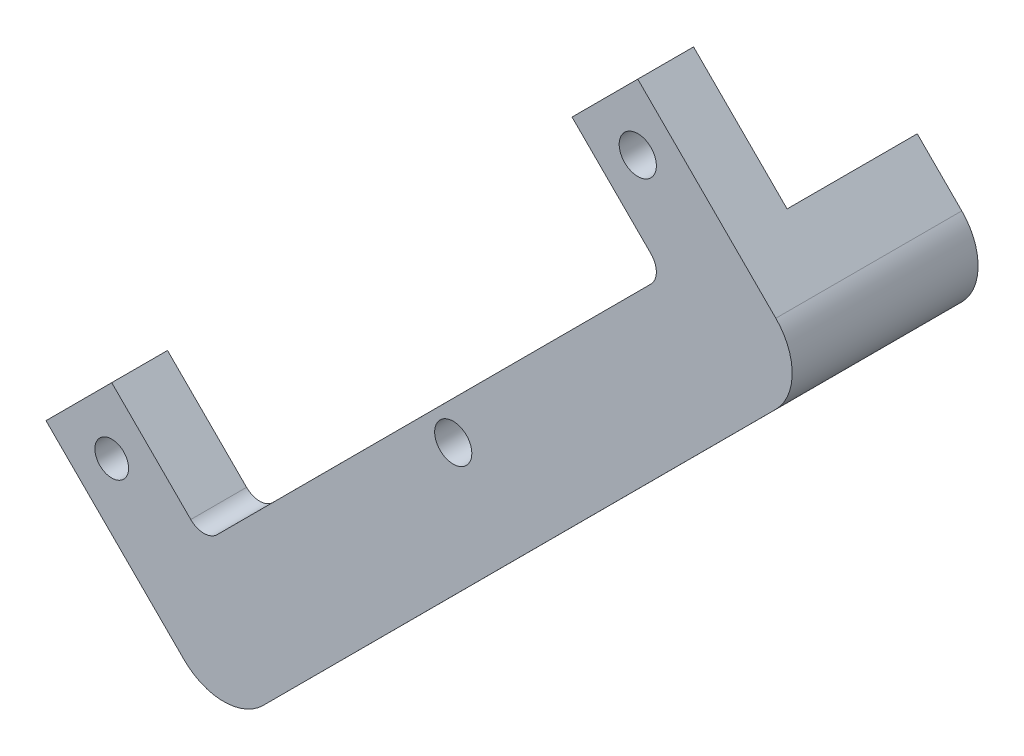
ISO-10303-21;
HEADER;
FILE_DESCRIPTION(('STEP AP214'),'2;1');
FILE_NAME('part.step','',(''),(''),'','','');
FILE_SCHEMA(('AUTOMOTIVE_DESIGN { 1 0 10303 214 1 1 1 1 }'));
ENDSEC;
DATA;
#1=APPLICATION_CONTEXT('core data for automotive mechanical design processes');
#2=APPLICATION_PROTOCOL_DEFINITION('international standard','automotive_design',2000,#1);
#3=PRODUCT_CONTEXT('',#1,'mechanical');
#4=PRODUCT('Part','Part','',(#3));
#5=PRODUCT_RELATED_PRODUCT_CATEGORY('part','',(#4));
#6=PRODUCT_DEFINITION_FORMATION('','',#4);
#7=PRODUCT_DEFINITION_CONTEXT('part definition',#1,'design');
#8=PRODUCT_DEFINITION('design','',#6,#7);
#9=PRODUCT_DEFINITION_SHAPE('','',#8);
#10=(LENGTH_UNIT() NAMED_UNIT(*) SI_UNIT(.MILLI.,.METRE.));
#11=(NAMED_UNIT(*) PLANE_ANGLE_UNIT() SI_UNIT($,.RADIAN.));
#12=(NAMED_UNIT(*) SI_UNIT($,.STERADIAN.) SOLID_ANGLE_UNIT());
#13=UNCERTAINTY_MEASURE_WITH_UNIT(LENGTH_MEASURE(1.E-05),#10,'distance_accuracy_value','');
#14=(GEOMETRIC_REPRESENTATION_CONTEXT(3) GLOBAL_UNCERTAINTY_ASSIGNED_CONTEXT((#13)) GLOBAL_UNIT_ASSIGNED_CONTEXT((#10,
#11,#12)) REPRESENTATION_CONTEXT('',''));
#15=CARTESIAN_POINT('',(0.,0.,0.));
#16=DIRECTION('',(0.,0.,1.));
#17=DIRECTION('',(1.,0.,0.));
#18=AXIS2_PLACEMENT_3D('',#15,#16,#17);
#19=CARTESIAN_POINT('',(92.6165146210903,-50.9394969151445,63.5));
#20=DIRECTION('',(0.,0.,1.));
#21=DIRECTION('',(1.,0.,0.));
#22=AXIS2_PLACEMENT_3D('',#19,#20,#21);
#23=PLANE('',#22);
#24=CARTESIAN_POINT('',(92.6162377487817,-19.504668428214,63.5));
#25=DIRECTION('',(0.,0.,1.));
#26=DIRECTION('',(1.,0.,0.));
#27=AXIS2_PLACEMENT_3D('',#24,#25,#26);
#28=CIRCLE('',#27,6.34999999999999);
#29=CARTESIAN_POINT('',(98.9662377487817,-19.504668428214,63.5));
#30=VERTEX_POINT('',#29);
#31=EDGE_CURVE('E201',#30,#30,#28,.T.);
#32=ORIENTED_EDGE('',*,*,#31,.F.);
#33=EDGE_LOOP('',(#32));
#34=FACE_BOUND('',#33,.T.);
#35=CARTESIAN_POINT('',(-87.0262149886001,-199.105902462494,63.5));
#36=DIRECTION('',(0.,0.,1.));
#37=DIRECTION('',(1.,0.,0.));
#38=AXIS2_PLACEMENT_3D('',#35,#36,#37);
#39=CIRCLE('',#38,5.75436999999998);
#40=CARTESIAN_POINT('',(-81.2718449886001,-199.105902462494,63.5));
#41=VERTEX_POINT('',#40);
#42=EDGE_CURVE('E218',#41,#41,#39,.T.);
#43=ORIENTED_EDGE('',*,*,#42,.F.);
#44=EDGE_LOOP('',(#43));
#45=FACE_BOUND('',#44,.T.);
#46=CARTESIAN_POINT('',(92.6165146210903,-50.9394969151445,63.5));
#47=DIRECTION('',(0.,0.,-1.));
#48=DIRECTION('',(1.,0.,0.));
#49=AXIS2_PLACEMENT_3D('',#46,#47,#48);
#50=CIRCLE('',#49,6.3500000000001);
#51=CARTESIAN_POINT('',(97.1071647211348,-46.449890954821,63.5));
#52=VERTEX_POINT('',#51);
#53=CARTESIAN_POINT('',(97.1072438077199,-55.4290237690962,63.5));
#54=VERTEX_POINT('',#53);
#55=EDGE_CURVE('E171',#52,#54,#50,.T.);
#56=ORIENTED_EDGE('',*,*,#55,.T.);
#57=DIRECTION('',(-0.707012102984532,-0.707201446713304,0.));
#58=VECTOR('',#57,1.);
#59=CARTESIAN_POINT('',(97.1072438077199,-55.4290237690962,63.5));
#60=LINE('',#59,#58);
#61=CARTESIAN_POINT('',(-51.0565382785673,-203.632485350049,63.5));
#62=VERTEX_POINT('',#61);
#63=EDGE_CURVE('E103',#54,#62,#60,.T.);
#64=ORIENTED_EDGE('',*,*,#63,.T.);
#65=CARTESIAN_POINT('',(-55.5472674651968,-199.142958496098,63.5));
#66=DIRECTION('',(0.,0.,-1.));
#67=DIRECTION('',(-1.,0.,0.));
#68=AXIS2_PLACEMENT_3D('',#65,#66,#67);
#69=CIRCLE('',#68,6.34999999999998);
#70=CARTESIAN_POINT('',(-60.0358290430145,-203.634652493037,63.5));
#71=VERTEX_POINT('',#70);
#72=EDGE_CURVE('E259',#62,#71,#69,.T.);
#73=ORIENTED_EDGE('',*,*,#72,.T.);
#74=DIRECTION('',(-0.707353385344735,0.706860090994917,0.));
#75=VECTOR('',#74,1.);
#76=CARTESIAN_POINT('',(-87.0340460364035,-176.655263525602,63.5));
#77=LINE('',#76,#75);
#78=CARTESIAN_POINT('',(-87.0340460364035,-176.655263525602,63.5));
#79=VERTEX_POINT('',#78);
#80=EDGE_CURVE('E261',#71,#79,#77,.T.);
#81=ORIENTED_EDGE('',*,*,#80,.T.);
#82=DIRECTION('',(-0.706860090994917,-0.707353385344735,0.));
#83=VECTOR('',#82,1.);
#84=CARTESIAN_POINT('',(-87.0340460364035,-176.655263525602,63.5));
#85=LINE('',#84,#83);
#86=CARTESIAN_POINT('',(-109.476853925492,-199.113733510297,63.5));
#87=VERTEX_POINT('',#86);
#88=EDGE_CURVE('E263',#79,#87,#85,.T.);
#89=ORIENTED_EDGE('',*,*,#88,.T.);
#90=DIRECTION('',(0.707353385344735,-0.706860090994917,0.));
#91=VECTOR('',#90,1.);
#92=CARTESIAN_POINT('',(-109.476853925492,-199.113733510297,63.5));
#93=LINE('',#92,#91);
#94=CARTESIAN_POINT('',(-62.2707033179511,-246.286963476114,63.5));
#95=VERTEX_POINT('',#94);
#96=EDGE_CURVE('E265',#87,#95,#93,.T.);
#97=ORIENTED_EDGE('',*,*,#96,.T.);
#98=CARTESIAN_POINT('',(-48.805018584498,-232.811881485297,63.5));
#99=DIRECTION('',(0.,0.,1.));
#100=DIRECTION('',(-1.,0.,0.));
#101=AXIS2_PLACEMENT_3D('',#98,#99,#100);
#102=CIRCLE('',#101,19.05);
#103=CARTESIAN_POINT('',(-35.333068284354,-246.280699366256,63.5));
#104=VERTEX_POINT('',#103);
#105=EDGE_CURVE('E267',#95,#104,#102,.T.);
#106=ORIENTED_EDGE('',*,*,#105,.T.);
#107=DIRECTION('',(0.70702456068028,0.707188992133544,0.));
#108=VECTOR('',#107,1.);
#109=CARTESIAN_POINT('',(139.761564896449,-71.1453447358829,63.5));
#110=LINE('',#109,#108);
#111=CARTESIAN_POINT('',(139.761564896449,-71.1453447358829,63.5));
#112=VERTEX_POINT('',#111);
#113=EDGE_CURVE('E269',#104,#112,#110,.T.);
#114=ORIENTED_EDGE('',*,*,#113,.T.);
#115=CARTESIAN_POINT('',(126.289614596305,-57.6765268549236,63.5));
#116=DIRECTION('',(0.,0.,1.));
#117=DIRECTION('',(1.,0.,0.));
#118=AXIS2_PLACEMENT_3D('',#115,#116,#117);
#119=CIRCLE('',#118,19.05);
#120=CARTESIAN_POINT('',(139.761564896439,-44.2077089739538,63.5));
#121=VERTEX_POINT('',#120);
#122=EDGE_CURVE('E137',#112,#121,#119,.T.);
#123=ORIENTED_EDGE('',*,*,#122,.T.);
#124=DIRECTION('',(-0.707024560680821,0.707188992133003,0.));
#125=VECTOR('',#124,1.);
#126=CARTESIAN_POINT('',(124.048977284746,-28.491467113537,63.5));
#127=LINE('',#126,#125);
#128=CARTESIAN_POINT('',(92.616039982847,2.94878049102205,63.5));
#129=VERTEX_POINT('',#128);
#130=EDGE_CURVE('E130',#121,#129,#127,.T.);
#131=ORIENTED_EDGE('',*,*,#130,.T.);
#132=DIRECTION('',(-0.707012102984532,-0.707201446713304,0.));
#133=VECTOR('',#132,1.);
#134=CARTESIAN_POINT('',(92.616039982847,2.94878049102205,63.5));
#135=LINE('',#134,#133);
#136=CARTESIAN_POINT('',(70.1684050107191,-19.5048661446824,63.5));
#137=VERTEX_POINT('',#136);
#138=EDGE_CURVE('E134',#129,#137,#135,.T.);
#139=ORIENTED_EDGE('',*,*,#138,.T.);
#140=DIRECTION('',(0.707024560680821,-0.707188992133002,0.));
#141=VECTOR('',#140,1.);
#142=CARTESIAN_POINT('',(70.1684050107191,-19.5048661446824,63.5));
#143=LINE('',#142,#141);
#144=EDGE_CURVE('E72',#137,#52,#143,.T.);
#145=ORIENTED_EDGE('',*,*,#144,.T.);
#146=EDGE_LOOP('',(#56,#64,#73,#81,#89,#97,#106,#114,#123,#131,#139,#145));
#147=FACE_BOUND('',#146,.T.);
#148=CARTESIAN_POINT('',(29.5914730148158,-136.091254994588,63.5));
#149=DIRECTION('',(0.,0.,1.));
#150=DIRECTION('',(1.,0.,0.));
#151=AXIS2_PLACEMENT_3D('',#148,#149,#150);
#152=CIRCLE('',#151,6.35000000000006);
#153=CARTESIAN_POINT('',(35.9414730148159,-136.091254994588,63.5));
#154=VERTEX_POINT('',#153);
#155=EDGE_CURVE('E164',#154,#154,#152,.T.);
#156=ORIENTED_EDGE('',*,*,#155,.F.);
#157=EDGE_LOOP('',(#156));
#158=FACE_BOUND('',#157,.T.);
#159=ADVANCED_FACE('F46',(#34,#45,#147,#158),#23,.T.);
#160=CARTESIAN_POINT('',(92.6165146210903,-50.9394969151445,0.));
#161=DIRECTION('',(0.,0.,1.));
#162=DIRECTION('',(1.,0.,0.));
#163=AXIS2_PLACEMENT_3D('',#160,#161,#162);
#164=PLANE('',#163);
#165=DIRECTION('',(0.707353385344735,-0.706860090994917,0.));
#166=VECTOR('',#165,1.);
#167=CARTESIAN_POINT('',(-109.476853925492,-199.113733510297,0.));
#168=LINE('',#167,#166);
#169=CARTESIAN_POINT('',(-77.4325739117842,-231.135666472868,0.));
#170=VERTEX_POINT('',#169);
#171=CARTESIAN_POINT('',(-62.2707033179511,-246.286963476114,0.));
#172=VERTEX_POINT('',#171);
#173=EDGE_CURVE('E161',#170,#172,#168,.T.);
#174=ORIENTED_EDGE('',*,*,#173,.F.);
#175=DIRECTION('',(-0.706860090994917,-0.707353385344735,0.));
#176=VECTOR('',#175,1.);
#177=CARTESIAN_POINT('',(150.918009784377,-2.62572443387421,0.));
#178=LINE('',#177,#176);
#179=CARTESIAN_POINT('',(124.559760075478,-29.0023686961202,0.));
#180=VERTEX_POINT('',#179);
#181=EDGE_CURVE('E230',#180,#170,#178,.T.);
#182=ORIENTED_EDGE('',*,*,#181,.F.);
#183=DIRECTION('',(-0.707024560680821,0.707188992133002,0.));
#184=VECTOR('',#183,1.);
#185=CARTESIAN_POINT('',(92.616039982847,2.94878049102205,0.));
#186=LINE('',#185,#184);
#187=CARTESIAN_POINT('',(139.761564896439,-44.2077089739538,0.));
#188=VERTEX_POINT('',#187);
#189=EDGE_CURVE('E94',#188,#180,#186,.T.);
#190=ORIENTED_EDGE('',*,*,#189,.F.);
#191=CARTESIAN_POINT('',(126.289614596305,-57.6765268549236,0.));
#192=DIRECTION('',(0.,0.,1.));
#193=DIRECTION('',(1.,0.,0.));
#194=AXIS2_PLACEMENT_3D('',#191,#192,#193);
#195=CIRCLE('',#194,19.05);
#196=CARTESIAN_POINT('',(139.761564896449,-71.1453447358829,0.));
#197=VERTEX_POINT('',#196);
#198=EDGE_CURVE('E168',#197,#188,#195,.T.);
#199=ORIENTED_EDGE('',*,*,#198,.F.);
#200=DIRECTION('',(0.70702456068028,0.707188992133544,0.));
#201=VECTOR('',#200,1.);
#202=CARTESIAN_POINT('',(139.761564896449,-71.1453447358829,0.));
#203=LINE('',#202,#201);
#204=CARTESIAN_POINT('',(-35.333068284354,-246.280699366256,0.));
#205=VERTEX_POINT('',#204);
#206=EDGE_CURVE('E166',#205,#197,#203,.T.);
#207=ORIENTED_EDGE('',*,*,#206,.F.);
#208=CARTESIAN_POINT('',(-48.805018584498,-232.811881485297,0.));
#209=DIRECTION('',(0.,0.,1.));
#210=DIRECTION('',(-1.,0.,0.));
#211=AXIS2_PLACEMENT_3D('',#208,#209,#210);
#212=CIRCLE('',#211,19.05);
#213=EDGE_CURVE('E163',#172,#205,#212,.T.);
#214=ORIENTED_EDGE('',*,*,#213,.F.);
#215=EDGE_LOOP('',(#174,#182,#190,#199,#207,#214));
#216=FACE_BOUND('',#215,.T.);
#217=CARTESIAN_POINT('',(29.5914730148158,-136.091254994588,0.));
#218=DIRECTION('',(0.,0.,1.));
#219=DIRECTION('',(1.,0.,0.));
#220=AXIS2_PLACEMENT_3D('',#217,#218,#219);
#221=CIRCLE('',#220,6.35000000000006);
#222=CARTESIAN_POINT('',(35.9414730148159,-136.091254994588,0.));
#223=VERTEX_POINT('',#222);
#224=EDGE_CURVE('E252',#223,#223,#221,.T.);
#225=ORIENTED_EDGE('',*,*,#224,.T.);
#226=EDGE_LOOP('',(#225));
#227=FACE_BOUND('',#226,.T.);
#228=ADVANCED_FACE('F333',(#216,#227),#164,.F.);
#229=CARTESIAN_POINT('',(92.6165146210903,-50.9394969151445,63.5));
#230=DIRECTION('',(0.,0.,-1.));
#231=DIRECTION('',(-1.,0.,0.));
#232=AXIS2_PLACEMENT_3D('',#229,#230,#231);
#233=CYLINDRICAL_SURFACE('',#232,6.3500000000001);
#234=DIRECTION('',(0.,0.,-1.));
#235=VECTOR('',#234,1.);
#236=CARTESIAN_POINT('',(97.1071647211348,-46.449890954821,63.5));
#237=LINE('',#236,#235);
#238=CARTESIAN_POINT('',(97.1071647211348,-46.449890954821,44.45));
#239=VERTEX_POINT('',#238);
#240=EDGE_CURVE('E157',#52,#239,#237,.T.);
#241=ORIENTED_EDGE('',*,*,#240,.T.);
#242=CARTESIAN_POINT('',(92.6165146210903,-50.9394969151445,44.45));
#243=DIRECTION('',(0.,0.,1.));
#244=DIRECTION('',(1.,0.,0.));
#245=AXIS2_PLACEMENT_3D('',#242,#243,#244);
#246=CIRCLE('',#245,6.3500000000001);
#247=CARTESIAN_POINT('',(97.10724380772,-55.4290237690962,44.45));
#248=VERTEX_POINT('',#247);
#249=EDGE_CURVE('E63',#239,#248,#246,.F.);
#250=ORIENTED_EDGE('',*,*,#249,.T.);
#251=DIRECTION('',(0.,0.,-1.));
#252=VECTOR('',#251,1.);
#253=CARTESIAN_POINT('',(97.1072438077199,-55.4290237690962,63.5));
#254=LINE('',#253,#252);
#255=EDGE_CURVE('E197',#54,#248,#254,.T.);
#256=ORIENTED_EDGE('',*,*,#255,.F.);
#257=ORIENTED_EDGE('',*,*,#55,.F.);
#258=EDGE_LOOP('',(#241,#250,#256,#257));
#259=FACE_BOUND('',#258,.T.);
#260=ADVANCED_FACE('F48',(#259),#233,.F.);
#261=CARTESIAN_POINT('',(97.1072438077199,-55.4290237690962,63.5));
#262=DIRECTION('',(0.707201446713304,-0.707012102984532,0.));
#263=DIRECTION('',(0.707012102984532,0.707201446713304,0.));
#264=AXIS2_PLACEMENT_3D('',#261,#262,#263);
#265=PLANE('',#264);
#266=ORIENTED_EDGE('',*,*,#255,.T.);
#267=DIRECTION('',(-0.707012102984532,-0.707201446713304,0.));
#268=VECTOR('',#267,1.);
#269=CARTESIAN_POINT('',(97.1072438077199,-55.4290237690962,44.45));
#270=LINE('',#269,#268);
#271=CARTESIAN_POINT('',(-51.0565382785673,-203.63248535005,44.45));
#272=VERTEX_POINT('',#271);
#273=EDGE_CURVE('E243',#248,#272,#270,.T.);
#274=ORIENTED_EDGE('',*,*,#273,.T.);
#275=DIRECTION('',(0.,0.,-1.));
#276=VECTOR('',#275,1.);
#277=CARTESIAN_POINT('',(-51.0565382785673,-203.632485350049,63.5));
#278=LINE('',#277,#276);
#279=EDGE_CURVE('E194',#62,#272,#278,.T.);
#280=ORIENTED_EDGE('',*,*,#279,.F.);
#281=ORIENTED_EDGE('',*,*,#63,.F.);
#282=EDGE_LOOP('',(#266,#274,#280,#281));
#283=FACE_BOUND('',#282,.T.);
#284=ADVANCED_FACE('F315',(#283),#265,.F.);
#285=CARTESIAN_POINT('',(-55.5472674651968,-199.142958496098,63.5));
#286=DIRECTION('',(0.,0.,-1.));
#287=DIRECTION('',(-1.,0.,0.));
#288=AXIS2_PLACEMENT_3D('',#285,#286,#287);
#289=CYLINDRICAL_SURFACE('',#288,6.34999999999998);
#290=ORIENTED_EDGE('',*,*,#279,.T.);
#291=CARTESIAN_POINT('',(-55.5472674651968,-199.142958496098,44.45));
#292=DIRECTION('',(0.,0.,1.));
#293=DIRECTION('',(1.,0.,0.));
#294=AXIS2_PLACEMENT_3D('',#291,#292,#293);
#295=CIRCLE('',#294,6.34999999999998);
#296=CARTESIAN_POINT('',(-60.0358290430145,-203.634652493037,44.45));
#297=VERTEX_POINT('',#296);
#298=EDGE_CURVE('E246',#272,#297,#295,.F.);
#299=ORIENTED_EDGE('',*,*,#298,.T.);
#300=DIRECTION('',(0.,0.,-1.));
#301=VECTOR('',#300,1.);
#302=CARTESIAN_POINT('',(-60.0358290430145,-203.634652493037,63.5));
#303=LINE('',#302,#301);
#304=EDGE_CURVE('E191',#71,#297,#303,.T.);
#305=ORIENTED_EDGE('',*,*,#304,.F.);
#306=ORIENTED_EDGE('',*,*,#72,.F.);
#307=EDGE_LOOP('',(#290,#299,#305,#306));
#308=FACE_BOUND('',#307,.T.);
#309=ADVANCED_FACE('F307',(#308),#289,.F.);
#310=CARTESIAN_POINT('',(-87.0340460364035,-176.655263525602,63.5));
#311=DIRECTION('',(-0.706860090994917,-0.707353385344735,0.));
#312=DIRECTION('',(0.707353385344736,-0.706860090994917,0.));
#313=AXIS2_PLACEMENT_3D('',#310,#311,#312);
#314=PLANE('',#313);
#315=ORIENTED_EDGE('',*,*,#304,.T.);
#316=DIRECTION('',(-0.707353385344736,0.706860090994917,0.));
#317=VECTOR('',#316,1.);
#318=CARTESIAN_POINT('',(-87.0340460364035,-176.655263525602,44.45));
#319=LINE('',#318,#317);
#320=CARTESIAN_POINT('',(-87.0340460364034,-176.655263525602,44.45));
#321=VERTEX_POINT('',#320);
#322=EDGE_CURVE('E249',#297,#321,#319,.T.);
#323=ORIENTED_EDGE('',*,*,#322,.T.);
#324=DIRECTION('',(0.,0.,-1.));
#325=VECTOR('',#324,1.);
#326=CARTESIAN_POINT('',(-87.0340460364035,-176.655263525602,63.5));
#327=LINE('',#326,#325);
#328=EDGE_CURVE('E188',#79,#321,#327,.T.);
#329=ORIENTED_EDGE('',*,*,#328,.F.);
#330=ORIENTED_EDGE('',*,*,#80,.F.);
#331=EDGE_LOOP('',(#315,#323,#329,#330));
#332=FACE_BOUND('',#331,.T.);
#333=ADVANCED_FACE('F310',(#332),#314,.F.);
#334=CARTESIAN_POINT('',(-87.0340460364035,-176.655263525602,63.5));
#335=DIRECTION('',(0.707353385344735,-0.706860090994917,0.));
#336=DIRECTION('',(0.706860090994917,0.707353385344735,0.));
#337=AXIS2_PLACEMENT_3D('',#334,#335,#336);
#338=PLANE('',#337);
#339=ORIENTED_EDGE('',*,*,#328,.T.);
#340=DIRECTION('',(-0.706860090994917,-0.707353385344735,0.));
#341=VECTOR('',#340,1.);
#342=CARTESIAN_POINT('',(118.87372977067,29.396208528696,44.45));
#343=LINE('',#342,#341);
#344=CARTESIAN_POINT('',(-109.476853925492,-199.113733510297,44.45));
#345=VERTEX_POINT('',#344);
#346=EDGE_CURVE('E231',#321,#345,#343,.T.);
#347=ORIENTED_EDGE('',*,*,#346,.T.);
#348=DIRECTION('',(0.,0.,-1.));
#349=VECTOR('',#348,1.);
#350=CARTESIAN_POINT('',(-109.476853925492,-199.113733510297,63.5));
#351=LINE('',#350,#349);
#352=EDGE_CURVE('E185',#87,#345,#351,.T.);
#353=ORIENTED_EDGE('',*,*,#352,.F.);
#354=ORIENTED_EDGE('',*,*,#88,.F.);
#355=EDGE_LOOP('',(#339,#347,#353,#354));
#356=FACE_BOUND('',#355,.T.);
#357=ADVANCED_FACE('F328',(#356),#338,.F.);
#358=CARTESIAN_POINT('',(-109.476853925492,-199.113733510297,63.5));
#359=DIRECTION('',(0.706860090994917,0.707353385344735,0.));
#360=DIRECTION('',(-0.707353385344735,0.706860090994917,0.));
#361=AXIS2_PLACEMENT_3D('',#358,#359,#360);
#362=PLANE('',#361);
#363=ORIENTED_EDGE('',*,*,#352,.T.);
#364=DIRECTION('',(-0.707353385344735,0.706860090994917,0.));
#365=VECTOR('',#364,1.);
#366=CARTESIAN_POINT('',(-109.476853925492,-199.113733510297,44.45));
#367=LINE('',#366,#365);
#368=CARTESIAN_POINT('',(-77.4325739117842,-231.135666472868,44.45));
#369=VERTEX_POINT('',#368);
#370=EDGE_CURVE('E227',#369,#345,#367,.T.);
#371=ORIENTED_EDGE('',*,*,#370,.F.);
#372=DIRECTION('',(0.,0.,1.));
#373=VECTOR('',#372,1.);
#374=CARTESIAN_POINT('',(-77.4325739117842,-231.135666472868,44.45));
#375=LINE('',#374,#373);
#376=EDGE_CURVE('E224',#170,#369,#375,.T.);
#377=ORIENTED_EDGE('',*,*,#376,.F.);
#378=ORIENTED_EDGE('',*,*,#173,.T.);
#379=DIRECTION('',(0.,0.,-1.));
#380=VECTOR('',#379,1.);
#381=CARTESIAN_POINT('',(-62.2707033179511,-246.286963476114,63.5));
#382=LINE('',#381,#380);
#383=EDGE_CURVE('E182',#95,#172,#382,.T.);
#384=ORIENTED_EDGE('',*,*,#383,.F.);
#385=ORIENTED_EDGE('',*,*,#96,.F.);
#386=EDGE_LOOP('',(#363,#371,#377,#378,#384,#385));
#387=FACE_BOUND('',#386,.T.);
#388=ADVANCED_FACE('F325',(#387),#362,.F.);
#389=CARTESIAN_POINT('',(-48.805018584498,-232.811881485297,63.5));
#390=DIRECTION('',(0.,0.,-1.));
#391=DIRECTION('',(-1.,0.,0.));
#392=AXIS2_PLACEMENT_3D('',#389,#390,#391);
#393=CYLINDRICAL_SURFACE('',#392,19.05);
#394=ORIENTED_EDGE('',*,*,#213,.T.);
#395=DIRECTION('',(0.,0.,-1.));
#396=VECTOR('',#395,1.);
#397=CARTESIAN_POINT('',(-35.333068284354,-246.280699366256,63.5));
#398=LINE('',#397,#396);
#399=EDGE_CURVE('E179',#104,#205,#398,.T.);
#400=ORIENTED_EDGE('',*,*,#399,.F.);
#401=ORIENTED_EDGE('',*,*,#105,.F.);
#402=ORIENTED_EDGE('',*,*,#383,.T.);
#403=EDGE_LOOP('',(#394,#400,#401,#402));
#404=FACE_BOUND('',#403,.T.);
#405=ADVANCED_FACE('F332',(#404),#393,.T.);
#406=CARTESIAN_POINT('',(139.761564896449,-71.1453447358829,63.5));
#407=DIRECTION('',(-0.707188992133544,0.70702456068028,0.));
#408=DIRECTION('',(-0.70702456068028,-0.707188992133544,0.));
#409=AXIS2_PLACEMENT_3D('',#406,#407,#408);
#410=PLANE('',#409);
#411=CARTESIAN_POINT('',(-12.8850381185892,-223.827448501766,25.4));
#412=DIRECTION('',(0.707188992133544,-0.70702456068028,0.));
#413=DIRECTION('',(0.70702456068028,0.707188992133544,0.));
#414=AXIS2_PLACEMENT_3D('',#411,#412,#413);
#415=CIRCLE('',#414,5.75436999999999);
#416=CARTESIAN_POINT('',(-8.81655719734738,-219.758021381102,25.4));
#417=VERTEX_POINT('',#416);
#418=EDGE_CURVE('E213',#417,#417,#415,.T.);
#419=ORIENTED_EDGE('',*,*,#418,.F.);
#420=EDGE_LOOP('',(#419));
#421=FACE_BOUND('',#420,.T.);
#422=CARTESIAN_POINT('',(117.313534730684,-93.5985956003736,25.4));
#423=DIRECTION('',(0.707188992133544,-0.70702456068028,0.));
#424=DIRECTION('',(0.70702456068028,0.707188992133544,0.));
#425=AXIS2_PLACEMENT_3D('',#422,#423,#424);
#426=CIRCLE('',#425,6.34999999999999);
#427=CARTESIAN_POINT('',(121.803140691004,-89.1079455003256,25.4));
#428=VERTEX_POINT('',#427);
#429=EDGE_CURVE('E202',#428,#428,#426,.T.);
#430=ORIENTED_EDGE('',*,*,#429,.F.);
#431=EDGE_LOOP('',(#430));
#432=FACE_BOUND('',#431,.T.);
#433=ORIENTED_EDGE('',*,*,#206,.T.);
#434=DIRECTION('',(0.,0.,-1.));
#435=VECTOR('',#434,1.);
#436=CARTESIAN_POINT('',(139.761564896449,-71.1453447358829,63.5));
#437=LINE('',#436,#435);
#438=EDGE_CURVE('E176',#112,#197,#437,.T.);
#439=ORIENTED_EDGE('',*,*,#438,.F.);
#440=ORIENTED_EDGE('',*,*,#113,.F.);
#441=ORIENTED_EDGE('',*,*,#399,.T.);
#442=EDGE_LOOP('',(#433,#439,#440,#441));
#443=FACE_BOUND('',#442,.T.);
#444=ADVANCED_FACE('F275',(#421,#432,#443),#410,.F.);
#445=CARTESIAN_POINT('',(126.289614596305,-57.6765268549236,63.5));
#446=DIRECTION('',(0.,0.,-1.));
#447=DIRECTION('',(-1.,0.,0.));
#448=AXIS2_PLACEMENT_3D('',#445,#446,#447);
#449=CYLINDRICAL_SURFACE('',#448,19.05);
#450=ORIENTED_EDGE('',*,*,#198,.T.);
#451=DIRECTION('',(0.,0.,-1.));
#452=VECTOR('',#451,1.);
#453=CARTESIAN_POINT('',(139.761564896439,-44.2077089739538,63.5));
#454=LINE('',#453,#452);
#455=EDGE_CURVE('E151',#121,#188,#454,.T.);
#456=ORIENTED_EDGE('',*,*,#455,.F.);
#457=ORIENTED_EDGE('',*,*,#122,.F.);
#458=ORIENTED_EDGE('',*,*,#438,.T.);
#459=EDGE_LOOP('',(#450,#456,#457,#458));
#460=FACE_BOUND('',#459,.T.);
#461=ADVANCED_FACE('F278',(#460),#449,.T.);
#462=CARTESIAN_POINT('',(92.616039982847,2.94878049102205,63.5));
#463=DIRECTION('',(-0.707188992133003,-0.707024560680821,0.));
#464=DIRECTION('',(0.707024560680821,-0.707188992133003,0.));
#465=AXIS2_PLACEMENT_3D('',#462,#463,#464);
#466=PLANE('',#465);
#467=DIRECTION('',(0.,0.,1.));
#468=VECTOR('',#467,1.);
#469=CARTESIAN_POINT('',(124.559760075478,-29.0023686961202,63.5));
#470=LINE('',#469,#468);
#471=CARTESIAN_POINT('',(124.559760075478,-29.0023686961202,44.45));
#472=VERTEX_POINT('',#471);
#473=EDGE_CURVE('E13',#180,#472,#470,.T.);
#474=ORIENTED_EDGE('',*,*,#473,.T.);
#475=DIRECTION('',(-0.707024560680821,0.707188992133003,0.));
#476=VECTOR('',#475,1.);
#477=CARTESIAN_POINT('',(92.616039982847,2.94878049102205,44.45));
#478=LINE('',#477,#476);
#479=CARTESIAN_POINT('',(92.616039982847,2.94878049102205,44.45));
#480=VERTEX_POINT('',#479);
#481=EDGE_CURVE('E148',#472,#480,#478,.T.);
#482=ORIENTED_EDGE('',*,*,#481,.T.);
#483=DIRECTION('',(0.,0.,-1.));
#484=VECTOR('',#483,1.);
#485=CARTESIAN_POINT('',(92.616039982847,2.94878049102205,63.5));
#486=LINE('',#485,#484);
#487=EDGE_CURVE('E144',#129,#480,#486,.T.);
#488=ORIENTED_EDGE('',*,*,#487,.F.);
#489=ORIENTED_EDGE('',*,*,#130,.F.);
#490=ORIENTED_EDGE('',*,*,#455,.T.);
#491=ORIENTED_EDGE('',*,*,#189,.T.);
#492=EDGE_LOOP('',(#474,#482,#488,#489,#490,#491));
#493=FACE_BOUND('',#492,.T.);
#494=ADVANCED_FACE('F145',(#493),#466,.F.);
#495=CARTESIAN_POINT('',(92.616039982847,2.94878049102205,63.5));
#496=DIRECTION('',(0.707201446713304,-0.707012102984532,0.));
#497=DIRECTION('',(0.707012102984532,0.707201446713304,0.));
#498=AXIS2_PLACEMENT_3D('',#495,#496,#497);
#499=PLANE('',#498);
#500=ORIENTED_EDGE('',*,*,#487,.T.);
#501=DIRECTION('',(-0.707012102984532,-0.707201446713304,0.));
#502=VECTOR('',#501,1.);
#503=CARTESIAN_POINT('',(92.616039982847,2.94878049102205,44.45));
#504=LINE('',#503,#502);
#505=CARTESIAN_POINT('',(70.1684050107191,-19.5048661446824,44.45));
#506=VERTEX_POINT('',#505);
#507=EDGE_CURVE('E234',#480,#506,#504,.T.);
#508=ORIENTED_EDGE('',*,*,#507,.T.);
#509=DIRECTION('',(0.,0.,-1.));
#510=VECTOR('',#509,1.);
#511=CARTESIAN_POINT('',(70.1684050107191,-19.5048661446824,63.5));
#512=LINE('',#511,#510);
#513=EDGE_CURVE('E152',#137,#506,#512,.T.);
#514=ORIENTED_EDGE('',*,*,#513,.F.);
#515=ORIENTED_EDGE('',*,*,#138,.F.);
#516=EDGE_LOOP('',(#500,#508,#514,#515));
#517=FACE_BOUND('',#516,.T.);
#518=ADVANCED_FACE('F154',(#517),#499,.F.);
#519=CARTESIAN_POINT('',(70.1684050107191,-19.5048661446824,63.5));
#520=DIRECTION('',(0.707188992133002,0.707024560680821,0.));
#521=DIRECTION('',(-0.707024560680821,0.707188992133002,0.));
#522=AXIS2_PLACEMENT_3D('',#519,#520,#521);
#523=PLANE('',#522);
#524=ORIENTED_EDGE('',*,*,#513,.T.);
#525=DIRECTION('',(0.707024560680821,-0.707188992133002,0.));
#526=VECTOR('',#525,1.);
#527=CARTESIAN_POINT('',(70.1684050107191,-19.5048661446824,44.45));
#528=LINE('',#527,#526);
#529=EDGE_CURVE('E55',#506,#239,#528,.T.);
#530=ORIENTED_EDGE('',*,*,#529,.T.);
#531=ORIENTED_EDGE('',*,*,#240,.F.);
#532=ORIENTED_EDGE('',*,*,#144,.F.);
#533=EDGE_LOOP('',(#524,#530,#531,#532));
#534=FACE_BOUND('',#533,.T.);
#535=ADVANCED_FACE('F318',(#534),#523,.F.);
#536=CARTESIAN_POINT('',(29.5914730148158,-136.091254994588,63.5));
#537=DIRECTION('',(0.,0.,-1.));
#538=DIRECTION('',(-1.,0.,0.));
#539=AXIS2_PLACEMENT_3D('',#536,#537,#538);
#540=CYLINDRICAL_SURFACE('',#539,6.35000000000006);
#541=ORIENTED_EDGE('',*,*,#155,.T.);
#542=EDGE_LOOP('',(#541));
#543=FACE_BOUND('',#542,.T.);
#544=ORIENTED_EDGE('',*,*,#224,.F.);
#545=EDGE_LOOP('',(#544));
#546=FACE_BOUND('',#545,.T.);
#547=ADVANCED_FACE('F340',(#543,#546),#540,.F.);
#548=CARTESIAN_POINT('',(150.918009784377,-2.62572443387421,44.45));
#549=DIRECTION('',(0.707353385344735,-0.706860090994917,0.));
#550=DIRECTION('',(0.706860090994917,0.707353385344735,0.));
#551=AXIS2_PLACEMENT_3D('',#548,#549,#550);
#552=PLANE('',#551);
#553=CARTESIAN_POINT('',(-41.5205570176446,-195.198587766284,25.4));
#554=DIRECTION('',(0.707353385344735,-0.706860090994917,0.));
#555=DIRECTION('',(-0.706860090994917,-0.707353385344735,0.));
#556=AXIS2_PLACEMENT_3D('',#553,#554,#555);
#557=ELLIPSE('',#556,5.75437015558492,5.75436999999997);
#558=CARTESIAN_POINT('',(-45.5880916294398,-199.268960976364,25.4));
#559=VERTEX_POINT('',#558);
#560=EDGE_CURVE('E50',#559,#559,#557,.T.);
#561=ORIENTED_EDGE('',*,*,#560,.T.);
#562=EDGE_LOOP('',(#561));
#563=FACE_BOUND('',#562,.T.);
#564=CARTESIAN_POINT('',(88.6477322585209,-64.9394583331438,25.4));
#565=DIRECTION('',(0.707353385344735,-0.706860090994917,0.));
#566=DIRECTION('',(-0.706860090994917,-0.707353385344735,0.));
#567=AXIS2_PLACEMENT_3D('',#564,#565,#566);
#568=ELLIPSE('',#567,6.35000017168938,6.34999999999997);
#569=CARTESIAN_POINT('',(84.1591705593428,-69.4311524515279,25.4));
#570=VERTEX_POINT('',#569);
#571=EDGE_CURVE('E199',#570,#570,#568,.T.);
#572=ORIENTED_EDGE('',*,*,#571,.T.);
#573=EDGE_LOOP('',(#572));
#574=FACE_BOUND('',#573,.T.);
#575=ORIENTED_EDGE('',*,*,#181,.T.);
#576=ORIENTED_EDGE('',*,*,#376,.T.);
#577=DIRECTION('',(-0.706860090994917,-0.707353385344735,0.));
#578=VECTOR('',#577,1.);
#579=CARTESIAN_POINT('',(150.918009784377,-2.62572443387421,44.45));
#580=LINE('',#579,#578);
#581=EDGE_CURVE('E235',#472,#369,#580,.T.);
#582=ORIENTED_EDGE('',*,*,#581,.F.);
#583=ORIENTED_EDGE('',*,*,#473,.F.);
#584=EDGE_LOOP('',(#575,#576,#582,#583));
#585=FACE_BOUND('',#584,.T.);
#586=ADVANCED_FACE('F319',(#563,#574,#585),#552,.F.);
#587=CARTESIAN_POINT('',(118.87372977067,29.396208528696,44.45));
#588=DIRECTION('',(0.,0.,1.));
#589=DIRECTION('',(1.,0.,0.));
#590=AXIS2_PLACEMENT_3D('',#587,#588,#589);
#591=PLANE('',#590);
#592=CARTESIAN_POINT('',(92.6162377487817,-19.504668428214,44.45));
#593=DIRECTION('',(0.,0.,1.));
#594=DIRECTION('',(1.,0.,0.));
#595=AXIS2_PLACEMENT_3D('',#592,#593,#594);
#596=CIRCLE('',#595,6.34999999999999);
#597=CARTESIAN_POINT('',(98.9662377487817,-19.504668428214,44.45));
#598=VERTEX_POINT('',#597);
#599=EDGE_CURVE('E206',#598,#598,#596,.T.);
#600=ORIENTED_EDGE('',*,*,#599,.T.);
#601=EDGE_LOOP('',(#600));
#602=FACE_BOUND('',#601,.T.);
#603=CARTESIAN_POINT('',(-87.0262149886001,-199.105902462494,44.45));
#604=DIRECTION('',(0.,0.,1.));
#605=DIRECTION('',(1.,0.,0.));
#606=AXIS2_PLACEMENT_3D('',#603,#604,#605);
#607=CIRCLE('',#606,5.75436999999999);
#608=CARTESIAN_POINT('',(-81.2718449886001,-199.105902462494,44.45));
#609=VERTEX_POINT('',#608);
#610=EDGE_CURVE('E221',#609,#609,#607,.T.);
#611=ORIENTED_EDGE('',*,*,#610,.T.);
#612=EDGE_LOOP('',(#611));
#613=FACE_BOUND('',#612,.T.);
#614=ORIENTED_EDGE('',*,*,#298,.F.);
#615=ORIENTED_EDGE('',*,*,#273,.F.);
#616=ORIENTED_EDGE('',*,*,#249,.F.);
#617=ORIENTED_EDGE('',*,*,#529,.F.);
#618=ORIENTED_EDGE('',*,*,#507,.F.);
#619=ORIENTED_EDGE('',*,*,#481,.F.);
#620=ORIENTED_EDGE('',*,*,#581,.T.);
#621=ORIENTED_EDGE('',*,*,#370,.T.);
#622=ORIENTED_EDGE('',*,*,#346,.F.);
#623=ORIENTED_EDGE('',*,*,#322,.F.);
#624=EDGE_LOOP('',(#614,#615,#616,#617,#618,#619,#620,#621,#622,#623));
#625=FACE_BOUND('',#624,.T.);
#626=ADVANCED_FACE('F302',(#602,#613,#625),#591,.F.);
#627=CARTESIAN_POINT('',(-87.0262149886001,-199.105902462494,63.5));
#628=DIRECTION('',(0.,0.,1.));
#629=DIRECTION('',(1.,0.,0.));
#630=AXIS2_PLACEMENT_3D('',#627,#628,#629);
#631=CYLINDRICAL_SURFACE('',#630,5.75436999999999);
#632=ORIENTED_EDGE('',*,*,#42,.T.);
#633=EDGE_LOOP('',(#632));
#634=FACE_BOUND('',#633,.T.);
#635=ORIENTED_EDGE('',*,*,#610,.F.);
#636=EDGE_LOOP('',(#635));
#637=FACE_BOUND('',#636,.T.);
#638=ADVANCED_FACE('F469',(#634,#637),#631,.F.);
#639=CARTESIAN_POINT('',(92.6162377487817,-19.504668428214,63.5));
#640=DIRECTION('',(0.,0.,1.));
#641=DIRECTION('',(1.,0.,0.));
#642=AXIS2_PLACEMENT_3D('',#639,#640,#641);
#643=CYLINDRICAL_SURFACE('',#642,6.34999999999999);
#644=ORIENTED_EDGE('',*,*,#31,.T.);
#645=EDGE_LOOP('',(#644));
#646=FACE_BOUND('',#645,.T.);
#647=ORIENTED_EDGE('',*,*,#599,.F.);
#648=EDGE_LOOP('',(#647));
#649=FACE_BOUND('',#648,.T.);
#650=ADVANCED_FACE('F478',(#646,#649),#643,.F.);
#651=CARTESIAN_POINT('',(117.313534730684,-93.5985956003736,25.4));
#652=DIRECTION('',(0.707188992133544,-0.70702456068028,0.));
#653=DIRECTION('',(0.70702456068028,0.707188992133544,0.));
#654=AXIS2_PLACEMENT_3D('',#651,#652,#653);
#655=CYLINDRICAL_SURFACE('',#654,6.34999999999997);
#656=ORIENTED_EDGE('',*,*,#429,.T.);
#657=EDGE_LOOP('',(#656));
#658=FACE_BOUND('',#657,.T.);
#659=ORIENTED_EDGE('',*,*,#571,.F.);
#660=EDGE_LOOP('',(#659));
#661=FACE_BOUND('',#660,.T.);
#662=ADVANCED_FACE('F487',(#658,#661),#655,.F.);
#663=CARTESIAN_POINT('',(-12.8850381185892,-223.827448501766,25.4));
#664=DIRECTION('',(0.707188992133544,-0.70702456068028,0.));
#665=DIRECTION('',(0.70702456068028,0.707188992133544,0.));
#666=AXIS2_PLACEMENT_3D('',#663,#664,#665);
#667=CYLINDRICAL_SURFACE('',#666,5.75436999999997);
#668=ORIENTED_EDGE('',*,*,#418,.T.);
#669=EDGE_LOOP('',(#668));
#670=FACE_BOUND('',#669,.T.);
#671=ORIENTED_EDGE('',*,*,#560,.F.);
#672=EDGE_LOOP('',(#671));
#673=FACE_BOUND('',#672,.T.);
#674=ADVANCED_FACE('F496',(#670,#673),#667,.F.);
#675=CLOSED_SHELL('',(#159,#228,#260,#284,#309,#333,#357,#388,#405,#444,#461,#494,#518,#535,
#547,#586,#626,#638,#650,#662,#674));
#676=MANIFOLD_SOLID_BREP('B2',#675);
#677=ADVANCED_BREP_SHAPE_REPRESENTATION('',(#18,#676),#14);
#678=SHAPE_DEFINITION_REPRESENTATION(#9,#677);
ENDSEC;
END-ISO-10303-21;
